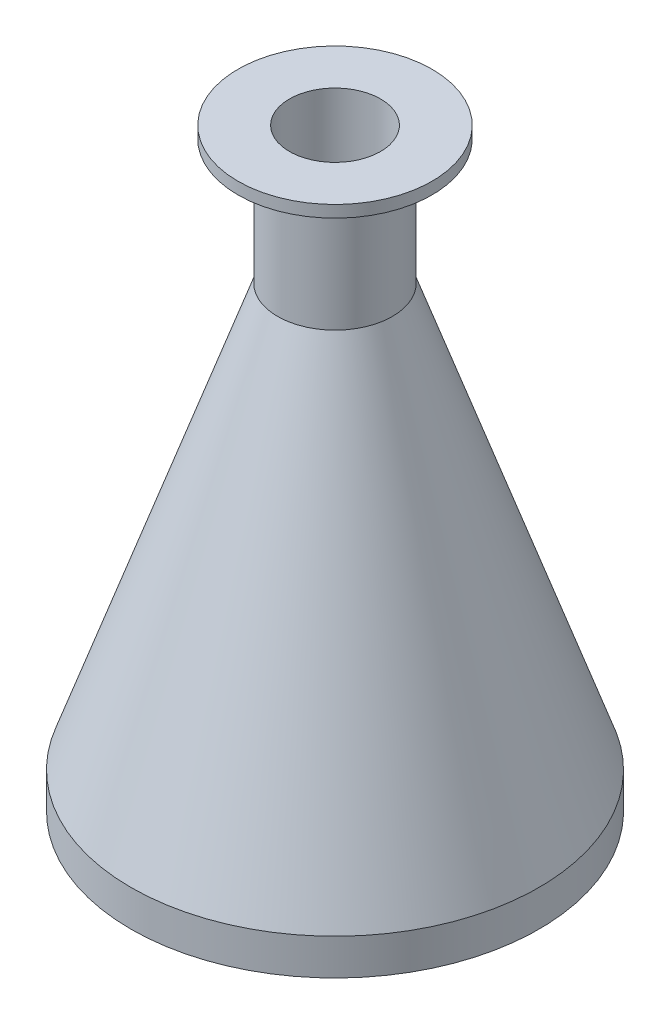
ISO-10303-21;
HEADER;
FILE_DESCRIPTION(('STEP AP214'),'2;1');
FILE_NAME('part.step','',(''),(''),'','','');
FILE_SCHEMA(('AUTOMOTIVE_DESIGN { 1 0 10303 214 1 1 1 1 }'));
ENDSEC;
DATA;
#1=APPLICATION_CONTEXT('core data for automotive mechanical design processes');
#2=APPLICATION_PROTOCOL_DEFINITION('international standard','automotive_design',2000,#1);
#3=PRODUCT_CONTEXT('',#1,'mechanical');
#4=PRODUCT('Part','Part','',(#3));
#5=PRODUCT_RELATED_PRODUCT_CATEGORY('part','',(#4));
#6=PRODUCT_DEFINITION_FORMATION('','',#4);
#7=PRODUCT_DEFINITION_CONTEXT('part definition',#1,'design');
#8=PRODUCT_DEFINITION('design','',#6,#7);
#9=PRODUCT_DEFINITION_SHAPE('','',#8);
#10=(LENGTH_UNIT() NAMED_UNIT(*) SI_UNIT(.MILLI.,.METRE.));
#11=(NAMED_UNIT(*) PLANE_ANGLE_UNIT() SI_UNIT($,.RADIAN.));
#12=(NAMED_UNIT(*) SI_UNIT($,.STERADIAN.) SOLID_ANGLE_UNIT());
#13=UNCERTAINTY_MEASURE_WITH_UNIT(LENGTH_MEASURE(1.E-05),#10,'distance_accuracy_value','');
#14=(GEOMETRIC_REPRESENTATION_CONTEXT(3) GLOBAL_UNCERTAINTY_ASSIGNED_CONTEXT((#13)) GLOBAL_UNIT_ASSIGNED_CONTEXT((#10,
#11,#12)) REPRESENTATION_CONTEXT('',''));
#15=CARTESIAN_POINT('',(0.,0.,0.));
#16=DIRECTION('',(0.,0.,1.));
#17=DIRECTION('',(1.,0.,0.));
#18=AXIS2_PLACEMENT_3D('',#15,#16,#17);
#19=CARTESIAN_POINT('',(0.,0.,0.));
#20=DIRECTION('',(0.,-1.,0.));
#21=DIRECTION('',(0.,0.,-1.));
#22=AXIS2_PLACEMENT_3D('',#19,#20,#21);
#23=CYLINDRICAL_SURFACE('',#22,24.5);
#24=CARTESIAN_POINT('',(0.,150.,0.));
#25=DIRECTION('',(0.,-1.,0.));
#26=DIRECTION('',(0.,0.,-1.));
#27=AXIS2_PLACEMENT_3D('',#24,#25,#26);
#28=CIRCLE('',#27,24.5);
#29=CARTESIAN_POINT('',(0.,150.,-24.5));
#30=VERTEX_POINT('',#29);
#31=EDGE_CURVE('E10',#30,#30,#28,.T.);
#32=ORIENTED_EDGE('',*,*,#31,.T.);
#33=EDGE_LOOP('',(#32));
#34=FACE_BOUND('',#33,.T.);
#35=CARTESIAN_POINT('',(0.,147.,0.));
#36=DIRECTION('',(0.,-1.,0.));
#37=DIRECTION('',(0.,0.,-1.));
#38=AXIS2_PLACEMENT_3D('',#35,#36,#37);
#39=CIRCLE('',#38,24.5);
#40=CARTESIAN_POINT('',(0.,147.,-24.5));
#41=VERTEX_POINT('',#40);
#42=EDGE_CURVE('E43',#41,#41,#39,.T.);
#43=ORIENTED_EDGE('',*,*,#42,.F.);
#44=EDGE_LOOP('',(#43));
#45=FACE_BOUND('',#44,.T.);
#46=ADVANCED_FACE('F37',(#34,#45),#23,.T.);
#47=CARTESIAN_POINT('',(24.5,147.,0.));
#48=DIRECTION('',(0.,-1.,0.));
#49=DIRECTION('',(0.,0.,-1.));
#50=AXIS2_PLACEMENT_3D('',#47,#48,#49);
#51=PLANE('',#50);
#52=ORIENTED_EDGE('',*,*,#42,.T.);
#53=EDGE_LOOP('',(#52));
#54=FACE_BOUND('',#53,.T.);
#55=CARTESIAN_POINT('',(0.,147.,0.));
#56=DIRECTION('',(0.,-1.,0.));
#57=DIRECTION('',(0.,0.,-1.));
#58=AXIS2_PLACEMENT_3D('',#55,#56,#57);
#59=CIRCLE('',#58,14.5);
#60=CARTESIAN_POINT('',(0.,147.,-14.5));
#61=VERTEX_POINT('',#60);
#62=EDGE_CURVE('E47',#61,#61,#59,.T.);
#63=ORIENTED_EDGE('',*,*,#62,.F.);
#64=EDGE_LOOP('',(#63));
#65=FACE_BOUND('',#64,.T.);
#66=ADVANCED_FACE('F88',(#54,#65),#51,.T.);
#67=CARTESIAN_POINT('',(0.,0.,0.));
#68=DIRECTION('',(0.,-1.,0.));
#69=DIRECTION('',(0.,0.,-1.));
#70=AXIS2_PLACEMENT_3D('',#67,#68,#69);
#71=CYLINDRICAL_SURFACE('',#70,14.5);
#72=ORIENTED_EDGE('',*,*,#62,.T.);
#73=EDGE_LOOP('',(#72));
#74=FACE_BOUND('',#73,.T.);
#75=CARTESIAN_POINT('',(0.,115.44961482983,0.));
#76=DIRECTION('',(0.,-1.,0.));
#77=DIRECTION('',(0.,0.,-1.));
#78=AXIS2_PLACEMENT_3D('',#75,#76,#77);
#79=CIRCLE('',#78,14.5);
#80=CARTESIAN_POINT('',(0.,115.44961482983,-14.5));
#81=VERTEX_POINT('',#80);
#82=EDGE_CURVE('E51',#81,#81,#79,.T.);
#83=ORIENTED_EDGE('',*,*,#82,.F.);
#84=EDGE_LOOP('',(#83));
#85=FACE_BOUND('',#84,.T.);
#86=ADVANCED_FACE('F92',(#74,#85),#71,.T.);
#87=CARTESIAN_POINT('',(0.,9.12777574937056,0.));
#88=DIRECTION('',(0.,-1.,0.));
#89=DIRECTION('',(0.,0.,-1.));
#90=AXIS2_PLACEMENT_3D('',#87,#88,#89);
#91=CONICAL_SURFACE('',#90,51.5,0.334891972282992);
#92=ORIENTED_EDGE('',*,*,#82,.T.);
#93=EDGE_LOOP('',(#92));
#94=FACE_BOUND('',#93,.T.);
#95=CARTESIAN_POINT('',(0.,9.12777574937056,0.));
#96=DIRECTION('',(0.,-1.,0.));
#97=DIRECTION('',(0.,0.,-1.));
#98=AXIS2_PLACEMENT_3D('',#95,#96,#97);
#99=CIRCLE('',#98,51.5);
#100=CARTESIAN_POINT('',(0.,9.12777574937056,-51.5));
#101=VERTEX_POINT('',#100);
#102=EDGE_CURVE('E57',#101,#101,#99,.T.);
#103=ORIENTED_EDGE('',*,*,#102,.F.);
#104=EDGE_LOOP('',(#103));
#105=FACE_BOUND('',#104,.T.);
#106=ADVANCED_FACE('F97',(#94,#105),#91,.T.);
#107=CARTESIAN_POINT('',(0.,0.,0.));
#108=DIRECTION('',(0.,-1.,0.));
#109=DIRECTION('',(0.,0.,-1.));
#110=AXIS2_PLACEMENT_3D('',#107,#108,#109);
#111=CYLINDRICAL_SURFACE('',#110,51.5);
#112=ORIENTED_EDGE('',*,*,#102,.T.);
#113=EDGE_LOOP('',(#112));
#114=FACE_BOUND('',#113,.T.);
#115=CARTESIAN_POINT('',(0.,0.,0.));
#116=DIRECTION('',(0.,-1.,0.));
#117=DIRECTION('',(0.,0.,-1.));
#118=AXIS2_PLACEMENT_3D('',#115,#116,#117);
#119=CIRCLE('',#118,51.5);
#120=CARTESIAN_POINT('',(0.,0.,-51.5));
#121=VERTEX_POINT('',#120);
#122=EDGE_CURVE('E60',#121,#121,#119,.T.);
#123=ORIENTED_EDGE('',*,*,#122,.F.);
#124=EDGE_LOOP('',(#123));
#125=FACE_BOUND('',#124,.T.);
#126=ADVANCED_FACE('F84',(#114,#125),#111,.T.);
#127=CARTESIAN_POINT('',(0.,114.942528735632,0.));
#128=DIRECTION('',(0.,-1.,0.));
#129=DIRECTION('',(0.,0.,-1.));
#130=AXIS2_PLACEMENT_3D('',#127,#128,#129);
#131=CONICAL_SURFACE('',#130,11.5,0.334891972282992);
#132=ORIENTED_EDGE('',*,*,#122,.T.);
#133=EDGE_LOOP('',(#132));
#134=FACE_BOUND('',#133,.T.);
#135=CARTESIAN_POINT('',(0.,114.942528735632,0.));
#136=DIRECTION('',(0.,-1.,0.));
#137=DIRECTION('',(0.,0.,-1.));
#138=AXIS2_PLACEMENT_3D('',#135,#136,#137);
#139=CIRCLE('',#138,11.5);
#140=CARTESIAN_POINT('',(0.,114.942528735632,-11.5));
#141=VERTEX_POINT('',#140);
#142=EDGE_CURVE('E63',#141,#141,#139,.T.);
#143=ORIENTED_EDGE('',*,*,#142,.F.);
#144=EDGE_LOOP('',(#143));
#145=FACE_BOUND('',#144,.T.);
#146=ADVANCED_FACE('F76',(#134,#145),#131,.F.);
#147=CARTESIAN_POINT('',(0.,0.,0.));
#148=DIRECTION('',(0.,-1.,0.));
#149=DIRECTION('',(0.,0.,-1.));
#150=AXIS2_PLACEMENT_3D('',#147,#148,#149);
#151=CYLINDRICAL_SURFACE('',#150,11.5);
#152=ORIENTED_EDGE('',*,*,#142,.T.);
#153=EDGE_LOOP('',(#152));
#154=FACE_BOUND('',#153,.T.);
#155=CARTESIAN_POINT('',(0.,150.,0.));
#156=DIRECTION('',(0.,-1.,0.));
#157=DIRECTION('',(0.,0.,-1.));
#158=AXIS2_PLACEMENT_3D('',#155,#156,#157);
#159=CIRCLE('',#158,11.5);
#160=CARTESIAN_POINT('',(0.,150.,-11.5));
#161=VERTEX_POINT('',#160);
#162=EDGE_CURVE('E67',#161,#161,#159,.T.);
#163=ORIENTED_EDGE('',*,*,#162,.F.);
#164=EDGE_LOOP('',(#163));
#165=FACE_BOUND('',#164,.T.);
#166=ADVANCED_FACE('F74',(#154,#165),#151,.F.);
#167=CARTESIAN_POINT('',(11.5,150.,0.));
#168=DIRECTION('',(0.,1.,0.));
#169=DIRECTION('',(0.,0.,1.));
#170=AXIS2_PLACEMENT_3D('',#167,#168,#169);
#171=PLANE('',#170);
#172=ORIENTED_EDGE('',*,*,#162,.T.);
#173=EDGE_LOOP('',(#172));
#174=FACE_BOUND('',#173,.T.);
#175=ORIENTED_EDGE('',*,*,#31,.F.);
#176=EDGE_LOOP('',(#175));
#177=FACE_BOUND('',#176,.T.);
#178=ADVANCED_FACE('F71',(#174,#177),#171,.T.);
#179=CLOSED_SHELL('',(#46,#66,#86,#106,#126,#146,#166,#178));
#180=MANIFOLD_SOLID_BREP('B2',#179);
#181=ADVANCED_BREP_SHAPE_REPRESENTATION('',(#18,#180),#14);
#182=SHAPE_DEFINITION_REPRESENTATION(#9,#181);
ENDSEC;
END-ISO-10303-21;
